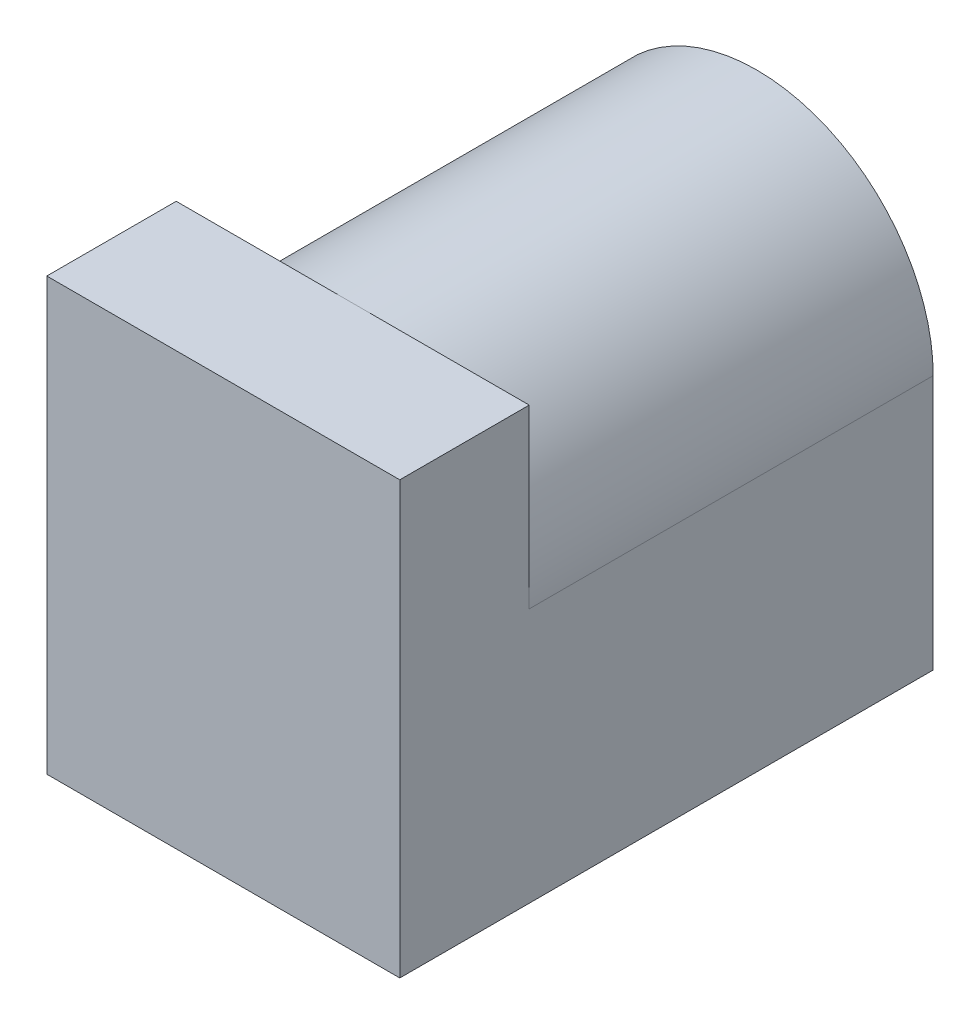
ISO-10303-21;
HEADER;
FILE_DESCRIPTION(('STEP AP214'),'2;1');
FILE_NAME('part.step','',(''),(''),'','','');
FILE_SCHEMA(('AUTOMOTIVE_DESIGN { 1 0 10303 214 1 1 1 1 }'));
ENDSEC;
DATA;
#1=APPLICATION_CONTEXT('core data for automotive mechanical design processes');
#2=APPLICATION_PROTOCOL_DEFINITION('international standard','automotive_design',2000,#1);
#3=PRODUCT_CONTEXT('',#1,'mechanical');
#4=PRODUCT('Part','Part','',(#3));
#5=PRODUCT_RELATED_PRODUCT_CATEGORY('part','',(#4));
#6=PRODUCT_DEFINITION_FORMATION('','',#4);
#7=PRODUCT_DEFINITION_CONTEXT('part definition',#1,'design');
#8=PRODUCT_DEFINITION('design','',#6,#7);
#9=PRODUCT_DEFINITION_SHAPE('','',#8);
#10=(LENGTH_UNIT() NAMED_UNIT(*) SI_UNIT(.MILLI.,.METRE.));
#11=(NAMED_UNIT(*) PLANE_ANGLE_UNIT() SI_UNIT($,.RADIAN.));
#12=(NAMED_UNIT(*) SI_UNIT($,.STERADIAN.) SOLID_ANGLE_UNIT());
#13=UNCERTAINTY_MEASURE_WITH_UNIT(LENGTH_MEASURE(1.E-05),#10,'distance_accuracy_value','');
#14=(GEOMETRIC_REPRESENTATION_CONTEXT(3) GLOBAL_UNCERTAINTY_ASSIGNED_CONTEXT((#13)) GLOBAL_UNIT_ASSIGNED_CONTEXT((#10,
#11,#12)) REPRESENTATION_CONTEXT('',''));
#15=CARTESIAN_POINT('',(0.,0.,0.));
#16=DIRECTION('',(0.,0.,1.));
#17=DIRECTION('',(1.,0.,0.));
#18=AXIS2_PLACEMENT_3D('',#15,#16,#17);
#19=CARTESIAN_POINT('',(0.,0.,0.));
#20=DIRECTION('',(0.,0.,-1.));
#21=DIRECTION('',(-1.,0.,0.));
#22=AXIS2_PLACEMENT_3D('',#19,#20,#21);
#23=PLANE('',#22);
#24=CARTESIAN_POINT('',(0.,1.,0.));
#25=DIRECTION('',(0.,0.,-1.));
#26=DIRECTION('',(-1.,0.,0.));
#27=AXIS2_PLACEMENT_3D('',#24,#25,#26);
#28=CIRCLE('',#27,4.5);
#29=CARTESIAN_POINT('',(-4.5,1.,0.));
#30=VERTEX_POINT('',#29);
#31=CARTESIAN_POINT('',(0.,5.5,0.));
#32=VERTEX_POINT('',#31);
#33=EDGE_CURVE('E43',#30,#32,#28,.T.);
#34=ORIENTED_EDGE('',*,*,#33,.F.);
#35=DIRECTION('',(0.,-1.,0.));
#36=VECTOR('',#35,1.);
#37=CARTESIAN_POINT('',(-4.5,-5.5,0.));
#38=LINE('',#37,#36);
#39=CARTESIAN_POINT('',(-4.5,5.5,0.));
#40=VERTEX_POINT('',#39);
#41=EDGE_CURVE('E123',#40,#30,#38,.T.);
#42=ORIENTED_EDGE('',*,*,#41,.F.);
#43=DIRECTION('',(-1.,0.,0.));
#44=VECTOR('',#43,1.);
#45=CARTESIAN_POINT('',(-4.5,5.5,0.));
#46=LINE('',#45,#44);
#47=EDGE_CURVE('E115',#32,#40,#46,.T.);
#48=ORIENTED_EDGE('',*,*,#47,.F.);
#49=EDGE_LOOP('',(#34,#42,#48));
#50=FACE_BOUND('',#49,.T.);
#51=ADVANCED_FACE('F33',(#50),#23,.T.);
#52=CARTESIAN_POINT('',(4.5,-5.5,3.3));
#53=DIRECTION('',(-1.,0.,0.));
#54=DIRECTION('',(0.,-1.,0.));
#55=AXIS2_PLACEMENT_3D('',#52,#53,#54);
#56=PLANE('',#55);
#57=DIRECTION('',(0.,0.,-1.));
#58=VECTOR('',#57,1.);
#59=CARTESIAN_POINT('',(4.5,-5.5,3.3));
#60=LINE('',#59,#58);
#61=CARTESIAN_POINT('',(4.5,-5.5,3.3));
#62=VERTEX_POINT('',#61);
#63=CARTESIAN_POINT('',(4.5,-5.5,-10.3));
#64=VERTEX_POINT('',#63);
#65=EDGE_CURVE('E96',#62,#64,#60,.T.);
#66=ORIENTED_EDGE('',*,*,#65,.T.);
#67=DIRECTION('',(0.,-1.,0.));
#68=VECTOR('',#67,1.);
#69=CARTESIAN_POINT('',(4.5,1.,-10.3));
#70=LINE('',#69,#68);
#71=CARTESIAN_POINT('',(4.5,1.,-10.3));
#72=VERTEX_POINT('',#71);
#73=EDGE_CURVE('E90',#72,#64,#70,.T.);
#74=ORIENTED_EDGE('',*,*,#73,.F.);
#75=DIRECTION('',(0.,0.,1.));
#76=VECTOR('',#75,1.);
#77=CARTESIAN_POINT('',(4.5,1.,-10.3));
#78=LINE('',#77,#76);
#79=CARTESIAN_POINT('',(4.5,1.,0.));
#80=VERTEX_POINT('',#79);
#81=EDGE_CURVE('E93',#72,#80,#78,.T.);
#82=ORIENTED_EDGE('',*,*,#81,.T.);
#83=DIRECTION('',(0.,1.,0.));
#84=VECTOR('',#83,1.);
#85=CARTESIAN_POINT('',(4.5,-5.5,0.));
#86=LINE('',#85,#84);
#87=CARTESIAN_POINT('',(4.5,5.5,0.));
#88=VERTEX_POINT('',#87);
#89=EDGE_CURVE('E112',#80,#88,#86,.T.);
#90=ORIENTED_EDGE('',*,*,#89,.T.);
#91=DIRECTION('',(0.,0.,-1.));
#92=VECTOR('',#91,1.);
#93=CARTESIAN_POINT('',(4.5,5.5,3.3));
#94=LINE('',#93,#92);
#95=CARTESIAN_POINT('',(4.5,5.5,3.3));
#96=VERTEX_POINT('',#95);
#97=EDGE_CURVE('E37',#96,#88,#94,.T.);
#98=ORIENTED_EDGE('',*,*,#97,.F.);
#99=DIRECTION('',(0.,1.,0.));
#100=VECTOR('',#99,1.);
#101=CARTESIAN_POINT('',(4.5,-5.5,3.3));
#102=LINE('',#101,#100);
#103=EDGE_CURVE('E119',#62,#96,#102,.T.);
#104=ORIENTED_EDGE('',*,*,#103,.F.);
#105=EDGE_LOOP('',(#66,#74,#82,#90,#98,#104));
#106=FACE_BOUND('',#105,.T.);
#107=ADVANCED_FACE('F35',(#106),#56,.F.);
#108=CARTESIAN_POINT('',(-4.5,5.5,3.3));
#109=DIRECTION('',(0.,-1.,0.));
#110=DIRECTION('',(0.,0.,-1.));
#111=AXIS2_PLACEMENT_3D('',#108,#109,#110);
#112=PLANE('',#111);
#113=EDGE_CURVE('E129',#88,#32,#46,.T.);
#114=ORIENTED_EDGE('',*,*,#113,.T.);
#115=ORIENTED_EDGE('',*,*,#47,.T.);
#116=DIRECTION('',(0.,0.,-1.));
#117=VECTOR('',#116,1.);
#118=CARTESIAN_POINT('',(-4.5,5.5,3.3));
#119=LINE('',#118,#117);
#120=CARTESIAN_POINT('',(-4.5,5.5,3.3));
#121=VERTEX_POINT('',#120);
#122=EDGE_CURVE('E135',#121,#40,#119,.T.);
#123=ORIENTED_EDGE('',*,*,#122,.F.);
#124=DIRECTION('',(-1.,0.,0.));
#125=VECTOR('',#124,1.);
#126=CARTESIAN_POINT('',(-4.5,5.5,3.3));
#127=LINE('',#126,#125);
#128=EDGE_CURVE('E122',#96,#121,#127,.T.);
#129=ORIENTED_EDGE('',*,*,#128,.F.);
#130=ORIENTED_EDGE('',*,*,#97,.T.);
#131=EDGE_LOOP('',(#114,#115,#123,#129,#130));
#132=FACE_BOUND('',#131,.T.);
#133=ADVANCED_FACE('F143',(#132),#112,.F.);
#134=CARTESIAN_POINT('',(-4.5,-5.5,3.3));
#135=DIRECTION('',(1.,0.,0.));
#136=DIRECTION('',(0.,0.,-1.));
#137=AXIS2_PLACEMENT_3D('',#134,#135,#136);
#138=PLANE('',#137);
#139=ORIENTED_EDGE('',*,*,#41,.T.);
#140=DIRECTION('',(0.,0.,1.));
#141=VECTOR('',#140,1.);
#142=CARTESIAN_POINT('',(-4.5,1.,-10.3));
#143=LINE('',#142,#141);
#144=CARTESIAN_POINT('',(-4.5,1.,-10.3));
#145=VERTEX_POINT('',#144);
#146=EDGE_CURVE('E113',#145,#30,#143,.T.);
#147=ORIENTED_EDGE('',*,*,#146,.F.);
#148=DIRECTION('',(0.,1.,0.));
#149=VECTOR('',#148,1.);
#150=CARTESIAN_POINT('',(-4.5,1.,-10.3));
#151=LINE('',#150,#149);
#152=CARTESIAN_POINT('',(-4.5,-5.5,-10.3));
#153=VERTEX_POINT('',#152);
#154=EDGE_CURVE('E106',#153,#145,#151,.T.);
#155=ORIENTED_EDGE('',*,*,#154,.F.);
#156=DIRECTION('',(0.,0.,-1.));
#157=VECTOR('',#156,1.);
#158=CARTESIAN_POINT('',(-4.5,-5.5,3.3));
#159=LINE('',#158,#157);
#160=CARTESIAN_POINT('',(-4.5,-5.5,3.3));
#161=VERTEX_POINT('',#160);
#162=EDGE_CURVE('E134',#161,#153,#159,.T.);
#163=ORIENTED_EDGE('',*,*,#162,.F.);
#164=DIRECTION('',(0.,-1.,0.));
#165=VECTOR('',#164,1.);
#166=CARTESIAN_POINT('',(-4.5,-5.5,3.3));
#167=LINE('',#166,#165);
#168=EDGE_CURVE('E125',#121,#161,#167,.T.);
#169=ORIENTED_EDGE('',*,*,#168,.F.);
#170=ORIENTED_EDGE('',*,*,#122,.T.);
#171=EDGE_LOOP('',(#139,#147,#155,#163,#169,#170));
#172=FACE_BOUND('',#171,.T.);
#173=ADVANCED_FACE('F164',(#172),#138,.F.);
#174=CARTESIAN_POINT('',(-4.5,-5.5,3.3));
#175=DIRECTION('',(0.,1.,0.));
#176=DIRECTION('',(-1.,0.,0.));
#177=AXIS2_PLACEMENT_3D('',#174,#175,#176);
#178=PLANE('',#177);
#179=ORIENTED_EDGE('',*,*,#162,.T.);
#180=DIRECTION('',(-1.,0.,0.));
#181=VECTOR('',#180,1.);
#182=CARTESIAN_POINT('',(4.5,-5.5,-10.3));
#183=LINE('',#182,#181);
#184=EDGE_CURVE('E100',#64,#153,#183,.T.);
#185=ORIENTED_EDGE('',*,*,#184,.F.);
#186=ORIENTED_EDGE('',*,*,#65,.F.);
#187=DIRECTION('',(1.,0.,0.));
#188=VECTOR('',#187,1.);
#189=CARTESIAN_POINT('',(-4.5,-5.5,3.3));
#190=LINE('',#189,#188);
#191=EDGE_CURVE('E127',#161,#62,#190,.T.);
#192=ORIENTED_EDGE('',*,*,#191,.F.);
#193=EDGE_LOOP('',(#179,#185,#186,#192));
#194=FACE_BOUND('',#193,.T.);
#195=ADVANCED_FACE('F153',(#194),#178,.F.);
#196=CARTESIAN_POINT('',(0.,0.,3.3));
#197=DIRECTION('',(0.,0.,-1.));
#198=DIRECTION('',(-1.,0.,0.));
#199=AXIS2_PLACEMENT_3D('',#196,#197,#198);
#200=PLANE('',#199);
#201=ORIENTED_EDGE('',*,*,#103,.T.);
#202=ORIENTED_EDGE('',*,*,#128,.T.);
#203=ORIENTED_EDGE('',*,*,#168,.T.);
#204=ORIENTED_EDGE('',*,*,#191,.T.);
#205=EDGE_LOOP('',(#201,#202,#203,#204));
#206=FACE_BOUND('',#205,.T.);
#207=ADVANCED_FACE('F146',(#206),#200,.F.);
#208=EDGE_CURVE('E11',#32,#80,#28,.T.);
#209=ORIENTED_EDGE('',*,*,#208,.F.);
#210=ORIENTED_EDGE('',*,*,#113,.F.);
#211=ORIENTED_EDGE('',*,*,#89,.F.);
#212=EDGE_LOOP('',(#209,#210,#211));
#213=FACE_BOUND('',#212,.T.);
#214=ADVANCED_FACE('F144',(#213),#23,.T.);
#215=CARTESIAN_POINT('',(0.,1.,-10.3));
#216=DIRECTION('',(0.,0.,1.));
#217=DIRECTION('',(1.,0.,0.));
#218=AXIS2_PLACEMENT_3D('',#215,#216,#217);
#219=CYLINDRICAL_SURFACE('',#218,4.5);
#220=ORIENTED_EDGE('',*,*,#33,.T.);
#221=ORIENTED_EDGE('',*,*,#208,.T.);
#222=ORIENTED_EDGE('',*,*,#81,.F.);
#223=CARTESIAN_POINT('',(0.,1.,-10.3));
#224=DIRECTION('',(0.,0.,-1.));
#225=DIRECTION('',(-1.,0.,0.));
#226=AXIS2_PLACEMENT_3D('',#223,#224,#225);
#227=CIRCLE('',#226,4.5);
#228=EDGE_CURVE('E101',#145,#72,#227,.T.);
#229=ORIENTED_EDGE('',*,*,#228,.F.);
#230=ORIENTED_EDGE('',*,*,#146,.T.);
#231=EDGE_LOOP('',(#220,#221,#222,#229,#230));
#232=FACE_BOUND('',#231,.T.);
#233=ADVANCED_FACE('F111',(#232),#219,.T.);
#234=CARTESIAN_POINT('',(0.,1.,-10.3));
#235=DIRECTION('',(0.,0.,-1.));
#236=DIRECTION('',(-1.,0.,0.));
#237=AXIS2_PLACEMENT_3D('',#234,#235,#236);
#238=PLANE('',#237);
#239=ORIENTED_EDGE('',*,*,#228,.T.);
#240=ORIENTED_EDGE('',*,*,#73,.T.);
#241=ORIENTED_EDGE('',*,*,#184,.T.);
#242=ORIENTED_EDGE('',*,*,#154,.T.);
#243=EDGE_LOOP('',(#239,#240,#241,#242));
#244=FACE_BOUND('',#243,.T.);
#245=ADVANCED_FACE('F104',(#244),#238,.T.);
#246=CLOSED_SHELL('',(#51,#107,#133,#173,#195,#207,#214,#233,#245));
#247=MANIFOLD_SOLID_BREP('B2',#246);
#248=ADVANCED_BREP_SHAPE_REPRESENTATION('',(#18,#247),#14);
#249=SHAPE_DEFINITION_REPRESENTATION(#9,#248);
ENDSEC;
END-ISO-10303-21;
